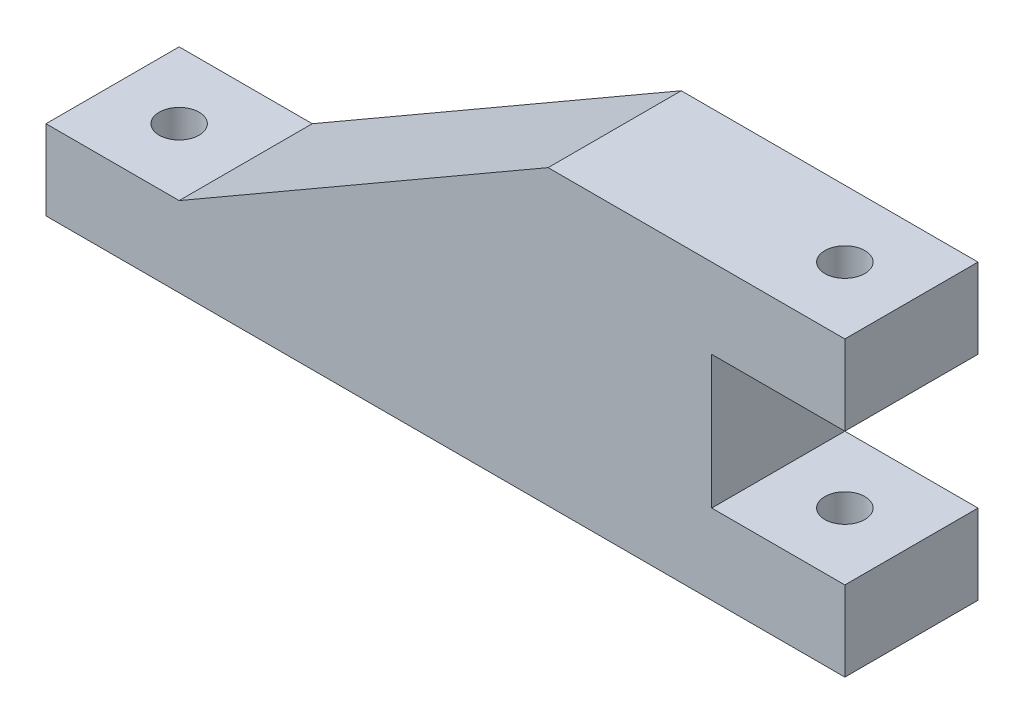
ISO-10303-21;
HEADER;
FILE_DESCRIPTION(('STEP AP214'),'2;1');
FILE_NAME('part.step','',(''),(''),'','','');
FILE_SCHEMA(('AUTOMOTIVE_DESIGN { 1 0 10303 214 1 1 1 1 }'));
ENDSEC;
DATA;
#1=APPLICATION_CONTEXT('core data for automotive mechanical design processes');
#2=APPLICATION_PROTOCOL_DEFINITION('international standard','automotive_design',2000,#1);
#3=PRODUCT_CONTEXT('',#1,'mechanical');
#4=PRODUCT('Part','Part','',(#3));
#5=PRODUCT_RELATED_PRODUCT_CATEGORY('part','',(#4));
#6=PRODUCT_DEFINITION_FORMATION('','',#4);
#7=PRODUCT_DEFINITION_CONTEXT('part definition',#1,'design');
#8=PRODUCT_DEFINITION('design','',#6,#7);
#9=PRODUCT_DEFINITION_SHAPE('','',#8);
#10=(LENGTH_UNIT() NAMED_UNIT(*) SI_UNIT(.MILLI.,.METRE.));
#11=(NAMED_UNIT(*) PLANE_ANGLE_UNIT() SI_UNIT($,.RADIAN.));
#12=(NAMED_UNIT(*) SI_UNIT($,.STERADIAN.) SOLID_ANGLE_UNIT());
#13=UNCERTAINTY_MEASURE_WITH_UNIT(LENGTH_MEASURE(1.E-05),#10,'distance_accuracy_value','');
#14=(GEOMETRIC_REPRESENTATION_CONTEXT(3) GLOBAL_UNCERTAINTY_ASSIGNED_CONTEXT((#13)) GLOBAL_UNIT_ASSIGNED_CONTEXT((#10,
#11,#12)) REPRESENTATION_CONTEXT('',''));
#15=CARTESIAN_POINT('',(0.,0.,0.));
#16=DIRECTION('',(0.,0.,1.));
#17=DIRECTION('',(1.,0.,0.));
#18=AXIS2_PLACEMENT_3D('',#15,#16,#17);
#19=CARTESIAN_POINT('',(-300.,30.,50.));
#20=DIRECTION('',(1.,0.,0.));
#21=DIRECTION('',(0.,0.,-1.));
#22=AXIS2_PLACEMENT_3D('',#19,#20,#21);
#23=PLANE('',#22);
#24=DIRECTION('',(0.,-1.,0.));
#25=VECTOR('',#24,1.);
#26=CARTESIAN_POINT('',(-300.,30.,0.));
#27=LINE('',#26,#25);
#28=CARTESIAN_POINT('',(-300.,30.,0.));
#29=VERTEX_POINT('',#28);
#30=CARTESIAN_POINT('',(-300.,0.,0.));
#31=VERTEX_POINT('',#30);
#32=EDGE_CURVE('E156',#29,#31,#27,.T.);
#33=ORIENTED_EDGE('',*,*,#32,.T.);
#34=DIRECTION('',(0.,0.,-1.));
#35=VECTOR('',#34,1.);
#36=CARTESIAN_POINT('',(-300.,0.,50.));
#37=LINE('',#36,#35);
#38=CARTESIAN_POINT('',(-300.,0.,50.));
#39=VERTEX_POINT('',#38);
#40=EDGE_CURVE('E11',#39,#31,#37,.T.);
#41=ORIENTED_EDGE('',*,*,#40,.F.);
#42=DIRECTION('',(0.,-1.,0.));
#43=VECTOR('',#42,1.);
#44=CARTESIAN_POINT('',(-300.,30.,50.));
#45=LINE('',#44,#43);
#46=CARTESIAN_POINT('',(-300.,30.,50.));
#47=VERTEX_POINT('',#46);
#48=EDGE_CURVE('E185',#47,#39,#45,.T.);
#49=ORIENTED_EDGE('',*,*,#48,.F.);
#50=DIRECTION('',(0.,0.,-1.));
#51=VECTOR('',#50,1.);
#52=CARTESIAN_POINT('',(-300.,30.,50.));
#53=LINE('',#52,#51);
#54=EDGE_CURVE('E152',#47,#29,#53,.T.);
#55=ORIENTED_EDGE('',*,*,#54,.T.);
#56=EDGE_LOOP('',(#33,#41,#49,#55));
#57=FACE_BOUND('',#56,.T.);
#58=ADVANCED_FACE('F42',(#57),#23,.F.);
#59=CARTESIAN_POINT('',(-300.,0.,50.));
#60=DIRECTION('',(0.,1.,0.));
#61=DIRECTION('',(0.,0.,1.));
#62=AXIS2_PLACEMENT_3D('',#59,#60,#61);
#63=PLANE('',#62);
#64=CARTESIAN_POINT('',(-275.,0.,25.));
#65=DIRECTION('',(0.,1.,0.));
#66=DIRECTION('',(-1.,0.,0.));
#67=AXIS2_PLACEMENT_3D('',#64,#65,#66);
#68=CIRCLE('',#67,7.50000000000001);
#69=CARTESIAN_POINT('',(-282.5,0.,25.));
#70=VERTEX_POINT('',#69);
#71=EDGE_CURVE('E259',#70,#70,#68,.T.);
#72=ORIENTED_EDGE('',*,*,#71,.T.);
#73=EDGE_LOOP('',(#72));
#74=FACE_BOUND('',#73,.T.);
#75=CARTESIAN_POINT('',(-25.,0.,25.));
#76=DIRECTION('',(0.,1.,0.));
#77=DIRECTION('',(-1.,0.,0.));
#78=AXIS2_PLACEMENT_3D('',#75,#76,#77);
#79=CIRCLE('',#78,7.5);
#80=CARTESIAN_POINT('',(-32.5,0.,25.));
#81=VERTEX_POINT('',#80);
#82=EDGE_CURVE('E260',#81,#81,#79,.T.);
#83=ORIENTED_EDGE('',*,*,#82,.T.);
#84=EDGE_LOOP('',(#83));
#85=FACE_BOUND('',#84,.T.);
#86=DIRECTION('',(1.,0.,0.));
#87=VECTOR('',#86,1.);
#88=CARTESIAN_POINT('',(-300.,0.,0.));
#89=LINE('',#88,#87);
#90=CARTESIAN_POINT('',(0.,0.,0.));
#91=VERTEX_POINT('',#90);
#92=EDGE_CURVE('E160',#31,#91,#89,.T.);
#93=ORIENTED_EDGE('',*,*,#92,.T.);
#94=DIRECTION('',(0.,0.,-1.));
#95=VECTOR('',#94,1.);
#96=CARTESIAN_POINT('',(0.,0.,50.));
#97=LINE('',#96,#95);
#98=CARTESIAN_POINT('',(0.,0.,50.));
#99=VERTEX_POINT('',#98);
#100=EDGE_CURVE('E52',#99,#91,#97,.T.);
#101=ORIENTED_EDGE('',*,*,#100,.F.);
#102=DIRECTION('',(1.,0.,0.));
#103=VECTOR('',#102,1.);
#104=CARTESIAN_POINT('',(-300.,0.,50.));
#105=LINE('',#104,#103);
#106=EDGE_CURVE('E109',#39,#99,#105,.T.);
#107=ORIENTED_EDGE('',*,*,#106,.F.);
#108=ORIENTED_EDGE('',*,*,#40,.T.);
#109=EDGE_LOOP('',(#93,#101,#107,#108));
#110=FACE_BOUND('',#109,.T.);
#111=ADVANCED_FACE('F288',(#74,#85,#110),#63,.F.);
#112=CARTESIAN_POINT('',(0.,0.,50.));
#113=DIRECTION('',(-1.,0.,0.));
#114=DIRECTION('',(0.,0.,1.));
#115=AXIS2_PLACEMENT_3D('',#112,#113,#114);
#116=PLANE('',#115);
#117=DIRECTION('',(0.,1.,0.));
#118=VECTOR('',#117,1.);
#119=CARTESIAN_POINT('',(0.,0.,0.));
#120=LINE('',#119,#118);
#121=CARTESIAN_POINT('',(0.,30.,0.));
#122=VERTEX_POINT('',#121);
#123=EDGE_CURVE('E164',#91,#122,#120,.T.);
#124=ORIENTED_EDGE('',*,*,#123,.T.);
#125=DIRECTION('',(0.,0.,-1.));
#126=VECTOR('',#125,1.);
#127=CARTESIAN_POINT('',(0.,30.,50.));
#128=LINE('',#127,#126);
#129=CARTESIAN_POINT('',(0.,30.,50.));
#130=VERTEX_POINT('',#129);
#131=EDGE_CURVE('E204',#130,#122,#128,.T.);
#132=ORIENTED_EDGE('',*,*,#131,.F.);
#133=DIRECTION('',(0.,1.,0.));
#134=VECTOR('',#133,1.);
#135=CARTESIAN_POINT('',(0.,0.,50.));
#136=LINE('',#135,#134);
#137=EDGE_CURVE('E215',#99,#130,#136,.T.);
#138=ORIENTED_EDGE('',*,*,#137,.F.);
#139=ORIENTED_EDGE('',*,*,#100,.T.);
#140=EDGE_LOOP('',(#124,#132,#138,#139));
#141=FACE_BOUND('',#140,.T.);
#142=ADVANCED_FACE('F213',(#141),#116,.F.);
#143=CARTESIAN_POINT('',(0.,30.,50.));
#144=DIRECTION('',(0.,-1.,0.));
#145=DIRECTION('',(1.,0.,0.));
#146=AXIS2_PLACEMENT_3D('',#143,#144,#145);
#147=PLANE('',#146);
#148=CARTESIAN_POINT('',(-25.,30.,25.));
#149=DIRECTION('',(0.,-1.,0.));
#150=DIRECTION('',(1.,0.,0.));
#151=AXIS2_PLACEMENT_3D('',#148,#149,#150);
#152=CIRCLE('',#151,7.5);
#153=CARTESIAN_POINT('',(-17.5,30.,25.));
#154=VERTEX_POINT('',#153);
#155=EDGE_CURVE('E161',#154,#154,#152,.T.);
#156=ORIENTED_EDGE('',*,*,#155,.T.);
#157=EDGE_LOOP('',(#156));
#158=FACE_BOUND('',#157,.T.);
#159=DIRECTION('',(-1.,0.,0.));
#160=VECTOR('',#159,1.);
#161=CARTESIAN_POINT('',(0.,30.,0.));
#162=LINE('',#161,#160);
#163=CARTESIAN_POINT('',(-50.,30.,0.));
#164=VERTEX_POINT('',#163);
#165=EDGE_CURVE('E167',#122,#164,#162,.T.);
#166=ORIENTED_EDGE('',*,*,#165,.T.);
#167=DIRECTION('',(0.,0.,-1.));
#168=VECTOR('',#167,1.);
#169=CARTESIAN_POINT('',(-50.,30.,50.));
#170=LINE('',#169,#168);
#171=CARTESIAN_POINT('',(-50.,30.,50.));
#172=VERTEX_POINT('',#171);
#173=EDGE_CURVE('E200',#172,#164,#170,.T.);
#174=ORIENTED_EDGE('',*,*,#173,.F.);
#175=DIRECTION('',(-1.,0.,0.));
#176=VECTOR('',#175,1.);
#177=CARTESIAN_POINT('',(0.,30.,50.));
#178=LINE('',#177,#176);
#179=EDGE_CURVE('E234',#130,#172,#178,.T.);
#180=ORIENTED_EDGE('',*,*,#179,.F.);
#181=ORIENTED_EDGE('',*,*,#131,.T.);
#182=EDGE_LOOP('',(#166,#174,#180,#181));
#183=FACE_BOUND('',#182,.T.);
#184=ADVANCED_FACE('F224',(#158,#183),#147,.F.);
#185=CARTESIAN_POINT('',(-50.,30.,50.));
#186=DIRECTION('',(-1.,0.,0.));
#187=DIRECTION('',(0.,-1.,0.));
#188=AXIS2_PLACEMENT_3D('',#185,#186,#187);
#189=PLANE('',#188);
#190=DIRECTION('',(0.,1.,0.));
#191=VECTOR('',#190,1.);
#192=CARTESIAN_POINT('',(-50.,30.,0.));
#193=LINE('',#192,#191);
#194=CARTESIAN_POINT('',(-50.,80.,0.));
#195=VERTEX_POINT('',#194);
#196=EDGE_CURVE('E170',#164,#195,#193,.T.);
#197=ORIENTED_EDGE('',*,*,#196,.T.);
#198=DIRECTION('',(0.,0.,-1.));
#199=VECTOR('',#198,1.);
#200=CARTESIAN_POINT('',(-50.,80.,50.));
#201=LINE('',#200,#199);
#202=CARTESIAN_POINT('',(-50.,80.,50.));
#203=VERTEX_POINT('',#202);
#204=EDGE_CURVE('E196',#203,#195,#201,.T.);
#205=ORIENTED_EDGE('',*,*,#204,.F.);
#206=DIRECTION('',(0.,1.,0.));
#207=VECTOR('',#206,1.);
#208=CARTESIAN_POINT('',(-50.,30.,50.));
#209=LINE('',#208,#207);
#210=EDGE_CURVE('E230',#172,#203,#209,.T.);
#211=ORIENTED_EDGE('',*,*,#210,.F.);
#212=ORIENTED_EDGE('',*,*,#173,.T.);
#213=EDGE_LOOP('',(#197,#205,#211,#212));
#214=FACE_BOUND('',#213,.T.);
#215=ADVANCED_FACE('F228',(#214),#189,.F.);
#216=CARTESIAN_POINT('',(-50.,80.,50.));
#217=DIRECTION('',(0.,1.,0.));
#218=DIRECTION('',(0.,0.,1.));
#219=AXIS2_PLACEMENT_3D('',#216,#217,#218);
#220=PLANE('',#219);
#221=CARTESIAN_POINT('',(-25.,80.,25.));
#222=DIRECTION('',(0.,1.,0.));
#223=DIRECTION('',(0.,0.,1.));
#224=AXIS2_PLACEMENT_3D('',#221,#222,#223);
#225=CIRCLE('',#224,7.5);
#226=CARTESIAN_POINT('',(-25.,80.,32.5));
#227=VERTEX_POINT('',#226);
#228=EDGE_CURVE('E251',#227,#227,#225,.T.);
#229=ORIENTED_EDGE('',*,*,#228,.T.);
#230=EDGE_LOOP('',(#229));
#231=FACE_BOUND('',#230,.T.);
#232=DIRECTION('',(1.,0.,0.));
#233=VECTOR('',#232,1.);
#234=CARTESIAN_POINT('',(-50.,80.,0.));
#235=LINE('',#234,#233);
#236=CARTESIAN_POINT('',(0.,80.,0.));
#237=VERTEX_POINT('',#236);
#238=EDGE_CURVE('E173',#195,#237,#235,.T.);
#239=ORIENTED_EDGE('',*,*,#238,.T.);
#240=DIRECTION('',(0.,0.,-1.));
#241=VECTOR('',#240,1.);
#242=CARTESIAN_POINT('',(0.,80.,50.));
#243=LINE('',#242,#241);
#244=CARTESIAN_POINT('',(0.,80.,50.));
#245=VERTEX_POINT('',#244);
#246=EDGE_CURVE('E192',#245,#237,#243,.T.);
#247=ORIENTED_EDGE('',*,*,#246,.F.);
#248=DIRECTION('',(1.,0.,0.));
#249=VECTOR('',#248,1.);
#250=CARTESIAN_POINT('',(-50.,80.,50.));
#251=LINE('',#250,#249);
#252=EDGE_CURVE('E233',#203,#245,#251,.T.);
#253=ORIENTED_EDGE('',*,*,#252,.F.);
#254=ORIENTED_EDGE('',*,*,#204,.T.);
#255=EDGE_LOOP('',(#239,#247,#253,#254));
#256=FACE_BOUND('',#255,.T.);
#257=ADVANCED_FACE('F300',(#231,#256),#220,.F.);
#258=CARTESIAN_POINT('',(0.,80.,50.));
#259=DIRECTION('',(-1.,0.,0.));
#260=DIRECTION('',(0.,0.,1.));
#261=AXIS2_PLACEMENT_3D('',#258,#259,#260);
#262=PLANE('',#261);
#263=DIRECTION('',(0.,1.,0.));
#264=VECTOR('',#263,1.);
#265=CARTESIAN_POINT('',(0.,80.,0.));
#266=LINE('',#265,#264);
#267=CARTESIAN_POINT('',(0.,110.,0.));
#268=VERTEX_POINT('',#267);
#269=EDGE_CURVE('E176',#237,#268,#266,.T.);
#270=ORIENTED_EDGE('',*,*,#269,.T.);
#271=DIRECTION('',(0.,0.,-1.));
#272=VECTOR('',#271,1.);
#273=CARTESIAN_POINT('',(0.,110.,50.));
#274=LINE('',#273,#272);
#275=CARTESIAN_POINT('',(0.,110.,50.));
#276=VERTEX_POINT('',#275);
#277=EDGE_CURVE('E145',#276,#268,#274,.T.);
#278=ORIENTED_EDGE('',*,*,#277,.F.);
#279=DIRECTION('',(0.,1.,0.));
#280=VECTOR('',#279,1.);
#281=CARTESIAN_POINT('',(0.,80.,50.));
#282=LINE('',#281,#280);
#283=EDGE_CURVE('E134',#245,#276,#282,.T.);
#284=ORIENTED_EDGE('',*,*,#283,.F.);
#285=ORIENTED_EDGE('',*,*,#246,.T.);
#286=EDGE_LOOP('',(#270,#278,#284,#285));
#287=FACE_BOUND('',#286,.T.);
#288=ADVANCED_FACE('F297',(#287),#262,.F.);
#289=CARTESIAN_POINT('',(0.,110.,50.));
#290=DIRECTION('',(0.,-1.,0.));
#291=DIRECTION('',(1.,0.,0.));
#292=AXIS2_PLACEMENT_3D('',#289,#290,#291);
#293=PLANE('',#292);
#294=CARTESIAN_POINT('',(-25.,110.,25.));
#295=DIRECTION('',(0.,1.,0.));
#296=DIRECTION('',(-1.,0.,0.));
#297=AXIS2_PLACEMENT_3D('',#294,#295,#296);
#298=CIRCLE('',#297,7.5);
#299=CARTESIAN_POINT('',(-32.5,110.,25.));
#300=VERTEX_POINT('',#299);
#301=EDGE_CURVE('E255',#300,#300,#298,.T.);
#302=ORIENTED_EDGE('',*,*,#301,.F.);
#303=EDGE_LOOP('',(#302));
#304=FACE_BOUND('',#303,.T.);
#305=DIRECTION('',(-1.,0.,0.));
#306=VECTOR('',#305,1.);
#307=CARTESIAN_POINT('',(0.,110.,0.));
#308=LINE('',#307,#306);
#309=CARTESIAN_POINT('',(-111.43593539449,110.,0.));
#310=VERTEX_POINT('',#309);
#311=EDGE_CURVE('E143',#268,#310,#308,.T.);
#312=ORIENTED_EDGE('',*,*,#311,.T.);
#313=DIRECTION('',(0.,0.,-1.));
#314=VECTOR('',#313,1.);
#315=CARTESIAN_POINT('',(-111.43593539449,110.,50.));
#316=LINE('',#315,#314);
#317=CARTESIAN_POINT('',(-111.43593539449,110.,50.));
#318=VERTEX_POINT('',#317);
#319=EDGE_CURVE('E140',#318,#310,#316,.T.);
#320=ORIENTED_EDGE('',*,*,#319,.F.);
#321=DIRECTION('',(-1.,0.,0.));
#322=VECTOR('',#321,1.);
#323=CARTESIAN_POINT('',(0.,110.,50.));
#324=LINE('',#323,#322);
#325=EDGE_CURVE('E128',#276,#318,#324,.T.);
#326=ORIENTED_EDGE('',*,*,#325,.F.);
#327=ORIENTED_EDGE('',*,*,#277,.T.);
#328=EDGE_LOOP('',(#312,#320,#326,#327));
#329=FACE_BOUND('',#328,.T.);
#330=ADVANCED_FACE('F141',(#304,#329),#293,.F.);
#331=CARTESIAN_POINT('',(-111.43593539449,110.,50.));
#332=DIRECTION('',(0.500000000000001,-0.866025403784438,0.));
#333=DIRECTION('',(0.866025403784438,0.500000000000001,0.));
#334=AXIS2_PLACEMENT_3D('',#331,#332,#333);
#335=PLANE('',#334);
#336=DIRECTION('',(-0.866025403784438,-0.500000000000001,0.));
#337=VECTOR('',#336,1.);
#338=CARTESIAN_POINT('',(-111.43593539449,110.,0.));
#339=LINE('',#338,#337);
#340=CARTESIAN_POINT('',(-250.,30.,0.));
#341=VERTEX_POINT('',#340);
#342=EDGE_CURVE('E95',#310,#341,#339,.T.);
#343=ORIENTED_EDGE('',*,*,#342,.T.);
#344=DIRECTION('',(0.,0.,-1.));
#345=VECTOR('',#344,1.);
#346=CARTESIAN_POINT('',(-250.,30.,50.));
#347=LINE('',#346,#345);
#348=CARTESIAN_POINT('',(-250.,30.,50.));
#349=VERTEX_POINT('',#348);
#350=EDGE_CURVE('E146',#349,#341,#347,.T.);
#351=ORIENTED_EDGE('',*,*,#350,.F.);
#352=DIRECTION('',(-0.866025403784438,-0.500000000000001,0.));
#353=VECTOR('',#352,1.);
#354=CARTESIAN_POINT('',(-111.43593539449,110.,50.));
#355=LINE('',#354,#353);
#356=EDGE_CURVE('E132',#318,#349,#355,.T.);
#357=ORIENTED_EDGE('',*,*,#356,.F.);
#358=ORIENTED_EDGE('',*,*,#319,.T.);
#359=EDGE_LOOP('',(#343,#351,#357,#358));
#360=FACE_BOUND('',#359,.T.);
#361=ADVANCED_FACE('F148',(#360),#335,.F.);
#362=CARTESIAN_POINT('',(-250.,30.,50.));
#363=DIRECTION('',(0.,-1.,0.));
#364=DIRECTION('',(1.,0.,0.));
#365=AXIS2_PLACEMENT_3D('',#362,#363,#364);
#366=PLANE('',#365);
#367=CARTESIAN_POINT('',(-275.,30.,25.));
#368=DIRECTION('',(0.,-1.,0.));
#369=DIRECTION('',(1.,0.,0.));
#370=AXIS2_PLACEMENT_3D('',#367,#368,#369);
#371=CIRCLE('',#370,7.50000000000001);
#372=CARTESIAN_POINT('',(-267.5,30.,25.));
#373=VERTEX_POINT('',#372);
#374=EDGE_CURVE('E45',#373,#373,#371,.T.);
#375=ORIENTED_EDGE('',*,*,#374,.T.);
#376=EDGE_LOOP('',(#375));
#377=FACE_BOUND('',#376,.T.);
#378=DIRECTION('',(-1.,0.,0.));
#379=VECTOR('',#378,1.);
#380=CARTESIAN_POINT('',(-250.,30.,0.));
#381=LINE('',#380,#379);
#382=EDGE_CURVE('E101',#341,#29,#381,.T.);
#383=ORIENTED_EDGE('',*,*,#382,.T.);
#384=ORIENTED_EDGE('',*,*,#54,.F.);
#385=DIRECTION('',(-1.,0.,0.));
#386=VECTOR('',#385,1.);
#387=CARTESIAN_POINT('',(-250.,30.,50.));
#388=LINE('',#387,#386);
#389=EDGE_CURVE('E60',#349,#47,#388,.T.);
#390=ORIENTED_EDGE('',*,*,#389,.F.);
#391=ORIENTED_EDGE('',*,*,#350,.T.);
#392=EDGE_LOOP('',(#383,#384,#390,#391));
#393=FACE_BOUND('',#392,.T.);
#394=ADVANCED_FACE('F272',(#377,#393),#366,.F.);
#395=CARTESIAN_POINT('',(0.,0.,50.));
#396=DIRECTION('',(0.,0.,1.));
#397=DIRECTION('',(1.,0.,0.));
#398=AXIS2_PLACEMENT_3D('',#395,#396,#397);
#399=PLANE('',#398);
#400=ORIENTED_EDGE('',*,*,#48,.T.);
#401=ORIENTED_EDGE('',*,*,#106,.T.);
#402=ORIENTED_EDGE('',*,*,#137,.T.);
#403=ORIENTED_EDGE('',*,*,#179,.T.);
#404=ORIENTED_EDGE('',*,*,#210,.T.);
#405=ORIENTED_EDGE('',*,*,#252,.T.);
#406=ORIENTED_EDGE('',*,*,#283,.T.);
#407=ORIENTED_EDGE('',*,*,#325,.T.);
#408=ORIENTED_EDGE('',*,*,#356,.T.);
#409=ORIENTED_EDGE('',*,*,#389,.T.);
#410=EDGE_LOOP('',(#400,#401,#402,#403,#404,#405,#406,#407,#408,#409));
#411=FACE_BOUND('',#410,.T.);
#412=ADVANCED_FACE('F130',(#411),#399,.T.);
#413=CARTESIAN_POINT('',(0.,0.,0.));
#414=DIRECTION('',(0.,0.,1.));
#415=DIRECTION('',(1.,0.,0.));
#416=AXIS2_PLACEMENT_3D('',#413,#414,#415);
#417=PLANE('',#416);
#418=ORIENTED_EDGE('',*,*,#32,.F.);
#419=ORIENTED_EDGE('',*,*,#382,.F.);
#420=ORIENTED_EDGE('',*,*,#342,.F.);
#421=ORIENTED_EDGE('',*,*,#311,.F.);
#422=ORIENTED_EDGE('',*,*,#269,.F.);
#423=ORIENTED_EDGE('',*,*,#238,.F.);
#424=ORIENTED_EDGE('',*,*,#196,.F.);
#425=ORIENTED_EDGE('',*,*,#165,.F.);
#426=ORIENTED_EDGE('',*,*,#123,.F.);
#427=ORIENTED_EDGE('',*,*,#92,.F.);
#428=EDGE_LOOP('',(#418,#419,#420,#421,#422,#423,#424,#425,#426,#427));
#429=FACE_BOUND('',#428,.T.);
#430=ADVANCED_FACE('F219',(#429),#417,.F.);
#431=CARTESIAN_POINT('',(-275.,0.,25.));
#432=DIRECTION('',(0.,1.,0.));
#433=DIRECTION('',(-1.,0.,0.));
#434=AXIS2_PLACEMENT_3D('',#431,#432,#433);
#435=CYLINDRICAL_SURFACE('',#434,7.50000000000001);
#436=ORIENTED_EDGE('',*,*,#71,.F.);
#437=EDGE_LOOP('',(#436));
#438=FACE_BOUND('',#437,.T.);
#439=ORIENTED_EDGE('',*,*,#374,.F.);
#440=EDGE_LOOP('',(#439));
#441=FACE_BOUND('',#440,.T.);
#442=ADVANCED_FACE('F274',(#438,#441),#435,.F.);
#443=CARTESIAN_POINT('',(-25.,0.,25.));
#444=DIRECTION('',(0.,1.,0.));
#445=DIRECTION('',(-1.,0.,0.));
#446=AXIS2_PLACEMENT_3D('',#443,#444,#445);
#447=CYLINDRICAL_SURFACE('',#446,7.5);
#448=ORIENTED_EDGE('',*,*,#301,.T.);
#449=EDGE_LOOP('',(#448));
#450=FACE_BOUND('',#449,.T.);
#451=ORIENTED_EDGE('',*,*,#228,.F.);
#452=EDGE_LOOP('',(#451));
#453=FACE_BOUND('',#452,.T.);
#454=ADVANCED_FACE('F276',(#450,#453),#447,.F.);
#455=ORIENTED_EDGE('',*,*,#82,.F.);
#456=EDGE_LOOP('',(#455));
#457=FACE_BOUND('',#456,.T.);
#458=ORIENTED_EDGE('',*,*,#155,.F.);
#459=EDGE_LOOP('',(#458));
#460=FACE_BOUND('',#459,.T.);
#461=ADVANCED_FACE('F283',(#457,#460),#447,.F.);
#462=CLOSED_SHELL('',(#58,#111,#142,#184,#215,#257,#288,#330,#361,#394,#412,#430,#442,#454,#461));
#463=MANIFOLD_SOLID_BREP('B2',#462);
#464=ADVANCED_BREP_SHAPE_REPRESENTATION('',(#18,#463),#14);
#465=SHAPE_DEFINITION_REPRESENTATION(#9,#464);
ENDSEC;
END-ISO-10303-21;
